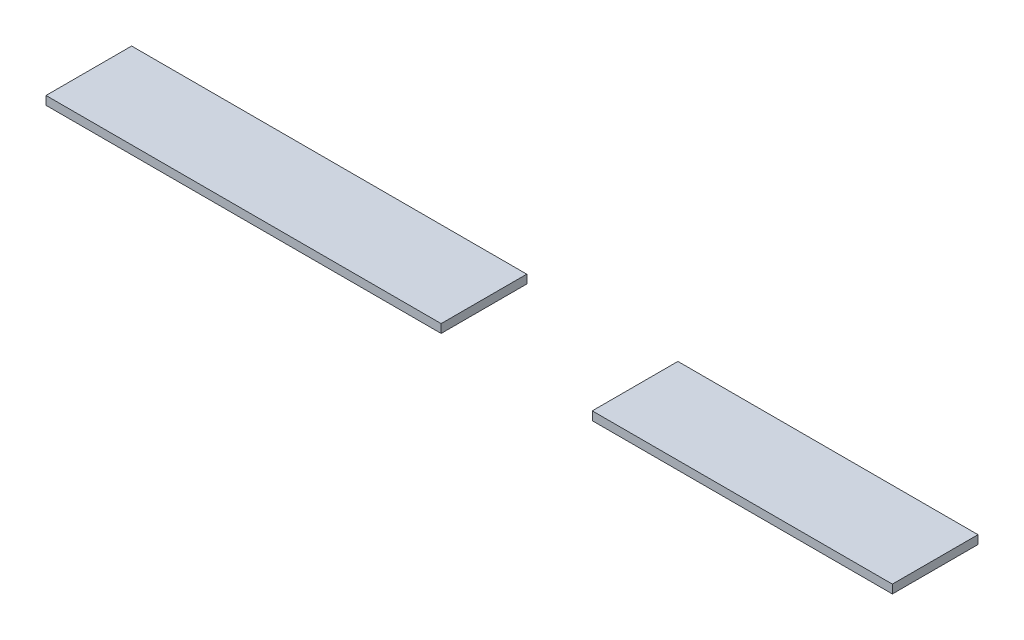
ISO-10303-21;
HEADER;
FILE_DESCRIPTION(('STEP AP214'),'2;1');
FILE_NAME('part.step','',(''),(''),'','','');
FILE_SCHEMA(('AUTOMOTIVE_DESIGN { 1 0 10303 214 1 1 1 1 }'));
ENDSEC;
DATA;
#1=APPLICATION_CONTEXT('core data for automotive mechanical design processes');
#2=APPLICATION_PROTOCOL_DEFINITION('international standard','automotive_design',2000,#1);
#3=PRODUCT_CONTEXT('',#1,'mechanical');
#4=PRODUCT('Part','Part','',(#3));
#5=PRODUCT_RELATED_PRODUCT_CATEGORY('part','',(#4));
#6=PRODUCT_DEFINITION_FORMATION('','',#4);
#7=PRODUCT_DEFINITION_CONTEXT('part definition',#1,'design');
#8=PRODUCT_DEFINITION('design','',#6,#7);
#9=PRODUCT_DEFINITION_SHAPE('','',#8);
#10=(LENGTH_UNIT() NAMED_UNIT(*) SI_UNIT(.MILLI.,.METRE.));
#11=(NAMED_UNIT(*) PLANE_ANGLE_UNIT() SI_UNIT($,.RADIAN.));
#12=(NAMED_UNIT(*) SI_UNIT($,.STERADIAN.) SOLID_ANGLE_UNIT());
#13=UNCERTAINTY_MEASURE_WITH_UNIT(LENGTH_MEASURE(1.E-05),#10,'distance_accuracy_value','');
#14=(GEOMETRIC_REPRESENTATION_CONTEXT(3) GLOBAL_UNCERTAINTY_ASSIGNED_CONTEXT((#13)) GLOBAL_UNIT_ASSIGNED_CONTEXT((#10,
#11,#12)) REPRESENTATION_CONTEXT('',''));
#15=CARTESIAN_POINT('',(0.,0.,0.));
#16=DIRECTION('',(0.,0.,1.));
#17=DIRECTION('',(1.,0.,0.));
#18=AXIS2_PLACEMENT_3D('',#15,#16,#17);
#19=CARTESIAN_POINT('',(-72.4371514588334,2.,12.4778653783412));
#20=DIRECTION('',(0.,0.,-1.));
#21=DIRECTION('',(-1.,0.,0.));
#22=AXIS2_PLACEMENT_3D('',#19,#20,#21);
#23=PLANE('',#22);
#24=DIRECTION('',(1.,0.,0.));
#25=VECTOR('',#24,1.);
#26=CARTESIAN_POINT('',(-72.4371514588334,2.,12.4778653783412));
#27=LINE('',#26,#25);
#28=CARTESIAN_POINT('',(55.1628485411666,2.,12.4778653783412));
#29=VERTEX_POINT('',#28);
#30=CARTESIAN_POINT('',(125.262848541167,2.,12.4778653783412));
#31=VERTEX_POINT('',#30);
#32=EDGE_CURVE('E86',#29,#31,#27,.T.);
#33=ORIENTED_EDGE('',*,*,#32,.F.);
#34=DIRECTION('',(0.,-1.,0.));
#35=VECTOR('',#34,1.);
#36=CARTESIAN_POINT('',(55.1628485411666,10.,12.4778653783412));
#37=LINE('',#36,#35);
#38=CARTESIAN_POINT('',(55.1628485411666,0.,12.4778653783412));
#39=VERTEX_POINT('',#38);
#40=EDGE_CURVE('E109',#29,#39,#37,.T.);
#41=ORIENTED_EDGE('',*,*,#40,.T.);
#42=DIRECTION('',(1.,0.,0.));
#43=VECTOR('',#42,1.);
#44=CARTESIAN_POINT('',(-72.4371514588334,0.,12.4778653783412));
#45=LINE('',#44,#43);
#46=CARTESIAN_POINT('',(125.262848541167,0.,12.4778653783412));
#47=VERTEX_POINT('',#46);
#48=EDGE_CURVE('E51',#39,#47,#45,.T.);
#49=ORIENTED_EDGE('',*,*,#48,.T.);
#50=DIRECTION('',(0.,-1.,0.));
#51=VECTOR('',#50,1.);
#52=CARTESIAN_POINT('',(125.262848541167,2.,12.4778653783412));
#53=LINE('',#52,#51);
#54=EDGE_CURVE('E12',#31,#47,#53,.T.);
#55=ORIENTED_EDGE('',*,*,#54,.F.);
#56=EDGE_LOOP('',(#33,#41,#49,#55));
#57=FACE_BOUND('',#56,.T.);
#58=ADVANCED_FACE('F48',(#57),#23,.F.);
#59=CARTESIAN_POINT('',(-72.4371514588334,2.,-7.52213462165877));
#60=DIRECTION('',(0.,0.,1.));
#61=DIRECTION('',(1.,0.,0.));
#62=AXIS2_PLACEMENT_3D('',#59,#60,#61);
#63=PLANE('',#62);
#64=DIRECTION('',(-1.,0.,0.));
#65=VECTOR('',#64,1.);
#66=CARTESIAN_POINT('',(-72.4371514588334,0.,-7.52213462165877));
#67=LINE('',#66,#65);
#68=CARTESIAN_POINT('',(125.262848541167,0.,-7.52213462165877));
#69=VERTEX_POINT('',#68);
#70=CARTESIAN_POINT('',(55.1628485411666,0.,-7.52213462165877));
#71=VERTEX_POINT('',#70);
#72=EDGE_CURVE('E105',#69,#71,#67,.T.);
#73=ORIENTED_EDGE('',*,*,#72,.T.);
#74=DIRECTION('',(0.,-1.,0.));
#75=VECTOR('',#74,1.);
#76=CARTESIAN_POINT('',(55.1628485411666,10.,-7.52213462165877));
#77=LINE('',#76,#75);
#78=CARTESIAN_POINT('',(55.1628485411666,2.,-7.52213462165877));
#79=VERTEX_POINT('',#78);
#80=EDGE_CURVE('E64',#79,#71,#77,.T.);
#81=ORIENTED_EDGE('',*,*,#80,.F.);
#82=DIRECTION('',(-1.,0.,0.));
#83=VECTOR('',#82,1.);
#84=CARTESIAN_POINT('',(-72.4371514588334,2.,-7.52213462165877));
#85=LINE('',#84,#83);
#86=CARTESIAN_POINT('',(125.262848541167,2.,-7.52213462165877));
#87=VERTEX_POINT('',#86);
#88=EDGE_CURVE('E100',#87,#79,#85,.T.);
#89=ORIENTED_EDGE('',*,*,#88,.F.);
#90=DIRECTION('',(0.,-1.,0.));
#91=VECTOR('',#90,1.);
#92=CARTESIAN_POINT('',(125.262848541167,2.,-7.52213462165877));
#93=LINE('',#92,#91);
#94=EDGE_CURVE('E95',#87,#69,#93,.T.);
#95=ORIENTED_EDGE('',*,*,#94,.T.);
#96=EDGE_LOOP('',(#73,#81,#89,#95));
#97=FACE_BOUND('',#96,.T.);
#98=ADVANCED_FACE('F129',(#97),#63,.F.);
#99=CARTESIAN_POINT('',(0.,2.,0.));
#100=DIRECTION('',(0.,1.,0.));
#101=DIRECTION('',(0.,0.,1.));
#102=AXIS2_PLACEMENT_3D('',#99,#100,#101);
#103=PLANE('',#102);
#104=DIRECTION('',(0.,0.,-1.));
#105=VECTOR('',#104,1.);
#106=CARTESIAN_POINT('',(55.1628485411666,2.,0.));
#107=LINE('',#106,#105);
#108=EDGE_CURVE('E92',#29,#79,#107,.T.);
#109=ORIENTED_EDGE('',*,*,#108,.F.);
#110=ORIENTED_EDGE('',*,*,#32,.T.);
#111=DIRECTION('',(0.,0.,-1.));
#112=VECTOR('',#111,1.);
#113=CARTESIAN_POINT('',(125.262848541167,2.,-7.52213462165877));
#114=LINE('',#113,#112);
#115=EDGE_CURVE('E91',#31,#87,#114,.T.);
#116=ORIENTED_EDGE('',*,*,#115,.T.);
#117=ORIENTED_EDGE('',*,*,#88,.T.);
#118=EDGE_LOOP('',(#109,#110,#116,#117));
#119=FACE_BOUND('',#118,.T.);
#120=ADVANCED_FACE('F88',(#119),#103,.T.);
#121=CARTESIAN_POINT('',(0.,0.,0.));
#122=DIRECTION('',(0.,1.,0.));
#123=DIRECTION('',(0.,0.,1.));
#124=AXIS2_PLACEMENT_3D('',#121,#122,#123);
#125=PLANE('',#124);
#126=ORIENTED_EDGE('',*,*,#48,.F.);
#127=DIRECTION('',(0.,0.,1.));
#128=VECTOR('',#127,1.);
#129=CARTESIAN_POINT('',(55.1628485411666,0.,12.4778653783412));
#130=LINE('',#129,#128);
#131=EDGE_CURVE('E115',#71,#39,#130,.T.);
#132=ORIENTED_EDGE('',*,*,#131,.F.);
#133=ORIENTED_EDGE('',*,*,#72,.F.);
#134=DIRECTION('',(0.,0.,-1.));
#135=VECTOR('',#134,1.);
#136=CARTESIAN_POINT('',(125.262848541167,0.,-7.52213462165877));
#137=LINE('',#136,#135);
#138=EDGE_CURVE('E56',#47,#69,#137,.T.);
#139=ORIENTED_EDGE('',*,*,#138,.F.);
#140=EDGE_LOOP('',(#126,#132,#133,#139));
#141=FACE_BOUND('',#140,.T.);
#142=ADVANCED_FACE('F121',(#141),#125,.F.);
#143=CARTESIAN_POINT('',(125.262848541167,2.,-7.52213462165877));
#144=DIRECTION('',(-1.,0.,0.));
#145=DIRECTION('',(0.,0.,1.));
#146=AXIS2_PLACEMENT_3D('',#143,#144,#145);
#147=PLANE('',#146);
#148=ORIENTED_EDGE('',*,*,#138,.T.);
#149=ORIENTED_EDGE('',*,*,#94,.F.);
#150=ORIENTED_EDGE('',*,*,#115,.F.);
#151=ORIENTED_EDGE('',*,*,#54,.T.);
#152=EDGE_LOOP('',(#148,#149,#150,#151));
#153=FACE_BOUND('',#152,.T.);
#154=ADVANCED_FACE('F98',(#153),#147,.F.);
#155=CARTESIAN_POINT('',(55.1628485411666,10.,12.4778653783412));
#156=DIRECTION('',(1.,0.,0.));
#157=DIRECTION('',(0.,0.,-1.));
#158=AXIS2_PLACEMENT_3D('',#155,#156,#157);
#159=PLANE('',#158);
#160=ORIENTED_EDGE('',*,*,#108,.T.);
#161=ORIENTED_EDGE('',*,*,#80,.T.);
#162=ORIENTED_EDGE('',*,*,#131,.T.);
#163=ORIENTED_EDGE('',*,*,#40,.F.);
#164=EDGE_LOOP('',(#160,#161,#162,#163));
#165=FACE_BOUND('',#164,.T.);
#166=ADVANCED_FACE('F118',(#165),#159,.F.);
#167=CLOSED_SHELL('',(#58,#98,#120,#142,#154,#166));
#168=MANIFOLD_SOLID_BREP('B2',#167);
#169=CARTESIAN_POINT('',(-72.4371514588334,2.,-7.52213462165877));
#170=DIRECTION('',(1.,0.,0.));
#171=DIRECTION('',(0.,0.,-1.));
#172=AXIS2_PLACEMENT_3D('',#169,#170,#171);
#173=PLANE('',#172);
#174=DIRECTION('',(0.,0.,1.));
#175=VECTOR('',#174,1.);
#176=CARTESIAN_POINT('',(-72.4371514588334,0.,-7.52213462165877));
#177=LINE('',#176,#175);
#178=CARTESIAN_POINT('',(-72.4371514588334,0.,-7.52213462165877));
#179=VERTEX_POINT('',#178);
#180=CARTESIAN_POINT('',(-72.4371514588334,0.,12.4778653783412));
#181=VERTEX_POINT('',#180);
#182=EDGE_CURVE('E222',#179,#181,#177,.T.);
#183=ORIENTED_EDGE('',*,*,#182,.T.);
#184=DIRECTION('',(0.,-1.,0.));
#185=VECTOR('',#184,1.);
#186=CARTESIAN_POINT('',(-72.4371514588334,2.,12.4778653783412));
#187=LINE('',#186,#185);
#188=CARTESIAN_POINT('',(-72.4371514588334,2.,12.4778653783412));
#189=VERTEX_POINT('',#188);
#190=EDGE_CURVE('E46',#189,#181,#187,.T.);
#191=ORIENTED_EDGE('',*,*,#190,.F.);
#192=DIRECTION('',(0.,0.,1.));
#193=VECTOR('',#192,1.);
#194=CARTESIAN_POINT('',(-72.4371514588334,2.,-7.52213462165877));
#195=LINE('',#194,#193);
#196=CARTESIAN_POINT('',(-72.4371514588334,2.,-7.52213462165877));
#197=VERTEX_POINT('',#196);
#198=EDGE_CURVE('E216',#197,#189,#195,.T.);
#199=ORIENTED_EDGE('',*,*,#198,.F.);
#200=DIRECTION('',(0.,-1.,0.));
#201=VECTOR('',#200,1.);
#202=CARTESIAN_POINT('',(-72.4371514588334,2.,-7.52213462165877));
#203=LINE('',#202,#201);
#204=EDGE_CURVE('E178',#197,#179,#203,.T.);
#205=ORIENTED_EDGE('',*,*,#204,.T.);
#206=EDGE_LOOP('',(#183,#191,#199,#205));
#207=FACE_BOUND('',#206,.T.);
#208=ADVANCED_FACE('F171',(#207),#173,.F.);
#209=CARTESIAN_POINT('',(0.,0.,0.));
#210=DIRECTION('',(0.,1.,0.));
#211=DIRECTION('',(0.,0.,1.));
#212=AXIS2_PLACEMENT_3D('',#209,#210,#211);
#213=PLANE('',#212);
#214=DIRECTION('',(-1.,0.,0.));
#215=VECTOR('',#214,1.);
#216=CARTESIAN_POINT('',(-72.4371514588334,0.,-7.52213462165877));
#217=LINE('',#216,#215);
#218=CARTESIAN_POINT('',(19.8628485411666,0.,-7.52213462165877));
#219=VERTEX_POINT('',#218);
#220=EDGE_CURVE('E207',#219,#179,#217,.T.);
#221=ORIENTED_EDGE('',*,*,#220,.F.);
#222=DIRECTION('',(0.,0.,-1.));
#223=VECTOR('',#222,1.);
#224=CARTESIAN_POINT('',(19.8628485411666,0.,12.4778653783412));
#225=LINE('',#224,#223);
#226=CARTESIAN_POINT('',(19.8628485411666,0.,12.4778653783412));
#227=VERTEX_POINT('',#226);
#228=EDGE_CURVE('E236',#227,#219,#225,.T.);
#229=ORIENTED_EDGE('',*,*,#228,.F.);
#230=DIRECTION('',(1.,0.,0.));
#231=VECTOR('',#230,1.);
#232=CARTESIAN_POINT('',(-72.4371514588334,0.,12.4778653783412));
#233=LINE('',#232,#231);
#234=EDGE_CURVE('E217',#181,#227,#233,.T.);
#235=ORIENTED_EDGE('',*,*,#234,.F.);
#236=ORIENTED_EDGE('',*,*,#182,.F.);
#237=EDGE_LOOP('',(#221,#229,#235,#236));
#238=FACE_BOUND('',#237,.T.);
#239=ADVANCED_FACE('F223',(#238),#213,.F.);
#240=CARTESIAN_POINT('',(0.,2.,0.));
#241=DIRECTION('',(0.,1.,0.));
#242=DIRECTION('',(0.,0.,1.));
#243=AXIS2_PLACEMENT_3D('',#240,#241,#242);
#244=PLANE('',#243);
#245=DIRECTION('',(0.,0.,1.));
#246=VECTOR('',#245,1.);
#247=CARTESIAN_POINT('',(19.8628485411666,2.,0.));
#248=LINE('',#247,#246);
#249=CARTESIAN_POINT('',(19.8628485411666,2.,-7.52213462165877));
#250=VERTEX_POINT('',#249);
#251=CARTESIAN_POINT('',(19.8628485411666,2.,12.4778653783412));
#252=VERTEX_POINT('',#251);
#253=EDGE_CURVE('E185',#250,#252,#248,.T.);
#254=ORIENTED_EDGE('',*,*,#253,.F.);
#255=DIRECTION('',(-1.,0.,0.));
#256=VECTOR('',#255,1.);
#257=CARTESIAN_POINT('',(-72.4371514588334,2.,-7.52213462165877));
#258=LINE('',#257,#256);
#259=EDGE_CURVE('E193',#250,#197,#258,.T.);
#260=ORIENTED_EDGE('',*,*,#259,.T.);
#261=ORIENTED_EDGE('',*,*,#198,.T.);
#262=DIRECTION('',(1.,0.,0.));
#263=VECTOR('',#262,1.);
#264=CARTESIAN_POINT('',(-72.4371514588334,2.,12.4778653783412));
#265=LINE('',#264,#263);
#266=EDGE_CURVE('E230',#189,#252,#265,.T.);
#267=ORIENTED_EDGE('',*,*,#266,.T.);
#268=EDGE_LOOP('',(#254,#260,#261,#267));
#269=FACE_BOUND('',#268,.T.);
#270=ADVANCED_FACE('F245',(#269),#244,.T.);
#271=CARTESIAN_POINT('',(-72.4371514588334,2.,-7.52213462165877));
#272=DIRECTION('',(0.,0.,1.));
#273=DIRECTION('',(1.,0.,0.));
#274=AXIS2_PLACEMENT_3D('',#271,#272,#273);
#275=PLANE('',#274);
#276=ORIENTED_EDGE('',*,*,#259,.F.);
#277=DIRECTION('',(0.,-1.,0.));
#278=VECTOR('',#277,1.);
#279=CARTESIAN_POINT('',(19.8628485411666,10.,-7.52213462165877));
#280=LINE('',#279,#278);
#281=EDGE_CURVE('E212',#250,#219,#280,.T.);
#282=ORIENTED_EDGE('',*,*,#281,.T.);
#283=ORIENTED_EDGE('',*,*,#220,.T.);
#284=ORIENTED_EDGE('',*,*,#204,.F.);
#285=EDGE_LOOP('',(#276,#282,#283,#284));
#286=FACE_BOUND('',#285,.T.);
#287=ADVANCED_FACE('F209',(#286),#275,.F.);
#288=CARTESIAN_POINT('',(-72.4371514588334,2.,12.4778653783412));
#289=DIRECTION('',(0.,0.,-1.));
#290=DIRECTION('',(-1.,0.,0.));
#291=AXIS2_PLACEMENT_3D('',#288,#289,#290);
#292=PLANE('',#291);
#293=ORIENTED_EDGE('',*,*,#234,.T.);
#294=DIRECTION('',(0.,-1.,0.));
#295=VECTOR('',#294,1.);
#296=CARTESIAN_POINT('',(19.8628485411666,10.,12.4778653783412));
#297=LINE('',#296,#295);
#298=EDGE_CURVE('E234',#252,#227,#297,.T.);
#299=ORIENTED_EDGE('',*,*,#298,.F.);
#300=ORIENTED_EDGE('',*,*,#266,.F.);
#301=ORIENTED_EDGE('',*,*,#190,.T.);
#302=EDGE_LOOP('',(#293,#299,#300,#301));
#303=FACE_BOUND('',#302,.T.);
#304=ADVANCED_FACE('F244',(#303),#292,.F.);
#305=CARTESIAN_POINT('',(19.8628485411666,10.,12.4778653783412));
#306=DIRECTION('',(-1.,0.,0.));
#307=DIRECTION('',(0.,0.,1.));
#308=AXIS2_PLACEMENT_3D('',#305,#306,#307);
#309=PLANE('',#308);
#310=ORIENTED_EDGE('',*,*,#253,.T.);
#311=ORIENTED_EDGE('',*,*,#298,.T.);
#312=ORIENTED_EDGE('',*,*,#228,.T.);
#313=ORIENTED_EDGE('',*,*,#281,.F.);
#314=EDGE_LOOP('',(#310,#311,#312,#313));
#315=FACE_BOUND('',#314,.T.);
#316=ADVANCED_FACE('F239',(#315),#309,.F.);
#317=CLOSED_SHELL('',(#208,#239,#270,#287,#304,#316));
#318=MANIFOLD_SOLID_BREP('B6',#317);
#319=ADVANCED_BREP_SHAPE_REPRESENTATION('',(#18,#168,#318),#14);
#320=SHAPE_DEFINITION_REPRESENTATION(#9,#319);
ENDSEC;
END-ISO-10303-21;
